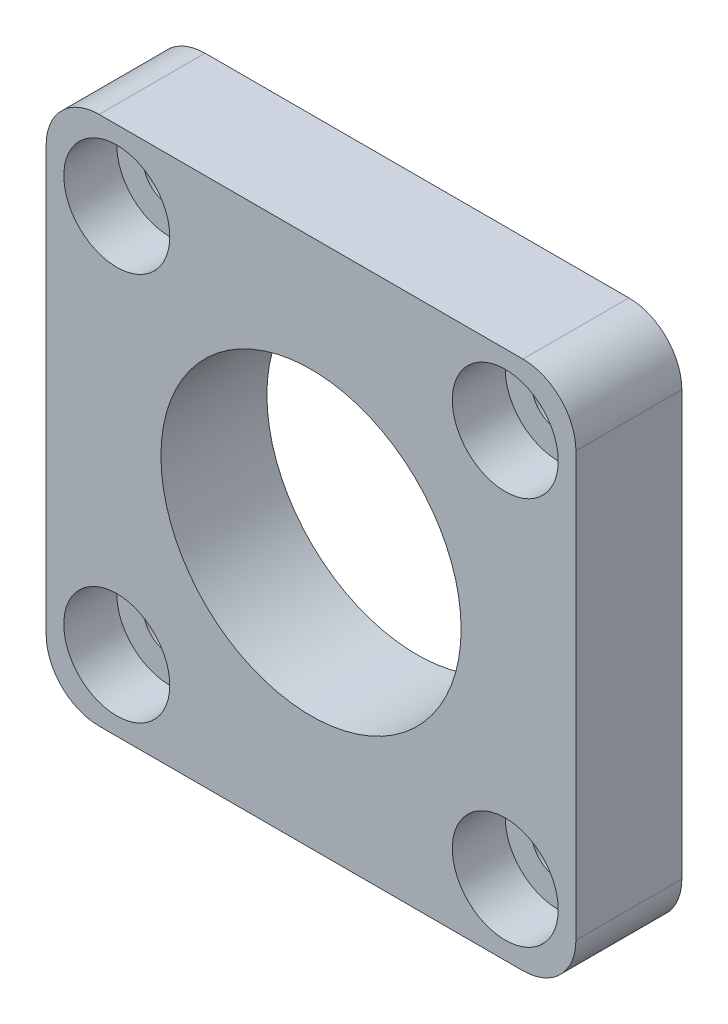
ISO-10303-21;
HEADER;
FILE_DESCRIPTION(('STEP AP214'),'2;1');
FILE_NAME('part.step','',(''),(''),'','','');
FILE_SCHEMA(('AUTOMOTIVE_DESIGN { 1 0 10303 214 1 1 1 1 }'));
ENDSEC;
DATA;
#1=APPLICATION_CONTEXT('core data for automotive mechanical design processes');
#2=APPLICATION_PROTOCOL_DEFINITION('international standard','automotive_design',2000,#1);
#3=PRODUCT_CONTEXT('',#1,'mechanical');
#4=PRODUCT('Part','Part','',(#3));
#5=PRODUCT_RELATED_PRODUCT_CATEGORY('part','',(#4));
#6=PRODUCT_DEFINITION_FORMATION('','',#4);
#7=PRODUCT_DEFINITION_CONTEXT('part definition',#1,'design');
#8=PRODUCT_DEFINITION('design','',#6,#7);
#9=PRODUCT_DEFINITION_SHAPE('','',#8);
#10=(LENGTH_UNIT() NAMED_UNIT(*) SI_UNIT(.MILLI.,.METRE.));
#11=(NAMED_UNIT(*) PLANE_ANGLE_UNIT() SI_UNIT($,.RADIAN.));
#12=(NAMED_UNIT(*) SI_UNIT($,.STERADIAN.) SOLID_ANGLE_UNIT());
#13=UNCERTAINTY_MEASURE_WITH_UNIT(LENGTH_MEASURE(1.E-05),#10,'distance_accuracy_value','');
#14=(GEOMETRIC_REPRESENTATION_CONTEXT(3) GLOBAL_UNCERTAINTY_ASSIGNED_CONTEXT((#13)) GLOBAL_UNIT_ASSIGNED_CONTEXT((#10,
#11,#12)) REPRESENTATION_CONTEXT('',''));
#15=CARTESIAN_POINT('',(0.,0.,0.));
#16=DIRECTION('',(0.,0.,1.));
#17=DIRECTION('',(1.,0.,0.));
#18=AXIS2_PLACEMENT_3D('',#15,#16,#17);
#19=CARTESIAN_POINT('',(-11.,-11.,0.));
#20=DIRECTION('',(0.,0.,1.));
#21=DIRECTION('',(1.,0.,0.));
#22=AXIS2_PLACEMENT_3D('',#19,#20,#21);
#23=CYLINDRICAL_SURFACE('',#22,1.5);
#24=CARTESIAN_POINT('',(-11.,-11.,0.));
#25=DIRECTION('',(0.,0.,1.));
#26=DIRECTION('',(1.,0.,0.));
#27=AXIS2_PLACEMENT_3D('',#24,#25,#26);
#28=CIRCLE('',#27,1.5);
#29=CARTESIAN_POINT('',(-9.5,-11.,0.));
#30=VERTEX_POINT('',#29);
#31=EDGE_CURVE('E138',#30,#30,#28,.T.);
#32=ORIENTED_EDGE('',*,*,#31,.F.);
#33=EDGE_LOOP('',(#32));
#34=FACE_BOUND('',#33,.T.);
#35=CARTESIAN_POINT('',(-11.,-11.,3.));
#36=DIRECTION('',(0.,0.,1.));
#37=DIRECTION('',(1.,0.,0.));
#38=AXIS2_PLACEMENT_3D('',#35,#36,#37);
#39=CIRCLE('',#38,1.5);
#40=CARTESIAN_POINT('',(-9.5,-11.,3.));
#41=VERTEX_POINT('',#40);
#42=EDGE_CURVE('E150',#41,#41,#39,.F.);
#43=ORIENTED_EDGE('',*,*,#42,.F.);
#44=EDGE_LOOP('',(#43));
#45=FACE_BOUND('',#44,.T.);
#46=ADVANCED_FACE('F33',(#34,#45),#23,.F.);
#47=CARTESIAN_POINT('',(11.,-11.,0.));
#48=DIRECTION('',(0.,0.,1.));
#49=DIRECTION('',(1.,0.,0.));
#50=AXIS2_PLACEMENT_3D('',#47,#48,#49);
#51=CYLINDRICAL_SURFACE('',#50,1.5);
#52=CARTESIAN_POINT('',(11.,-11.,0.));
#53=DIRECTION('',(0.,0.,1.));
#54=DIRECTION('',(1.,0.,0.));
#55=AXIS2_PLACEMENT_3D('',#52,#53,#54);
#56=CIRCLE('',#55,1.5);
#57=CARTESIAN_POINT('',(12.5,-11.,0.));
#58=VERTEX_POINT('',#57);
#59=EDGE_CURVE('E203',#58,#58,#56,.T.);
#60=ORIENTED_EDGE('',*,*,#59,.F.);
#61=EDGE_LOOP('',(#60));
#62=FACE_BOUND('',#61,.T.);
#63=CARTESIAN_POINT('',(11.,-11.,3.));
#64=DIRECTION('',(0.,0.,1.));
#65=DIRECTION('',(1.,0.,0.));
#66=AXIS2_PLACEMENT_3D('',#63,#64,#65);
#67=CIRCLE('',#66,1.5);
#68=CARTESIAN_POINT('',(12.5,-11.,3.));
#69=VERTEX_POINT('',#68);
#70=EDGE_CURVE('E145',#69,#69,#67,.F.);
#71=ORIENTED_EDGE('',*,*,#70,.F.);
#72=EDGE_LOOP('',(#71));
#73=FACE_BOUND('',#72,.T.);
#74=ADVANCED_FACE('F266',(#62,#73),#51,.F.);
#75=CARTESIAN_POINT('',(11.,11.,0.));
#76=DIRECTION('',(0.,0.,1.));
#77=DIRECTION('',(1.,0.,0.));
#78=AXIS2_PLACEMENT_3D('',#75,#76,#77);
#79=CYLINDRICAL_SURFACE('',#78,1.5);
#80=CARTESIAN_POINT('',(11.,11.,0.));
#81=DIRECTION('',(0.,0.,1.));
#82=DIRECTION('',(1.,0.,0.));
#83=AXIS2_PLACEMENT_3D('',#80,#81,#82);
#84=CIRCLE('',#83,1.5);
#85=CARTESIAN_POINT('',(12.5,11.,0.));
#86=VERTEX_POINT('',#85);
#87=EDGE_CURVE('E200',#86,#86,#84,.T.);
#88=ORIENTED_EDGE('',*,*,#87,.F.);
#89=EDGE_LOOP('',(#88));
#90=FACE_BOUND('',#89,.T.);
#91=CARTESIAN_POINT('',(11.,11.,3.));
#92=DIRECTION('',(0.,0.,1.));
#93=DIRECTION('',(1.,0.,0.));
#94=AXIS2_PLACEMENT_3D('',#91,#92,#93);
#95=CIRCLE('',#94,1.5);
#96=CARTESIAN_POINT('',(12.5,11.,3.));
#97=VERTEX_POINT('',#96);
#98=EDGE_CURVE('E140',#97,#97,#95,.F.);
#99=ORIENTED_EDGE('',*,*,#98,.F.);
#100=EDGE_LOOP('',(#99));
#101=FACE_BOUND('',#100,.T.);
#102=ADVANCED_FACE('F272',(#90,#101),#79,.F.);
#103=CARTESIAN_POINT('',(-11.,11.,0.));
#104=DIRECTION('',(0.,0.,1.));
#105=DIRECTION('',(1.,0.,0.));
#106=AXIS2_PLACEMENT_3D('',#103,#104,#105);
#107=CYLINDRICAL_SURFACE('',#106,1.5);
#108=CARTESIAN_POINT('',(-11.,11.,0.));
#109=DIRECTION('',(0.,0.,1.));
#110=DIRECTION('',(1.,0.,0.));
#111=AXIS2_PLACEMENT_3D('',#108,#109,#110);
#112=CIRCLE('',#111,1.5);
#113=CARTESIAN_POINT('',(-9.5,11.,0.));
#114=VERTEX_POINT('',#113);
#115=EDGE_CURVE('E196',#114,#114,#112,.T.);
#116=ORIENTED_EDGE('',*,*,#115,.F.);
#117=EDGE_LOOP('',(#116));
#118=FACE_BOUND('',#117,.T.);
#119=CARTESIAN_POINT('',(-11.,11.,3.));
#120=DIRECTION('',(0.,0.,1.));
#121=DIRECTION('',(1.,0.,0.));
#122=AXIS2_PLACEMENT_3D('',#119,#120,#121);
#123=CIRCLE('',#122,1.5);
#124=CARTESIAN_POINT('',(-9.5,11.,3.));
#125=VERTEX_POINT('',#124);
#126=EDGE_CURVE('E135',#125,#125,#123,.F.);
#127=ORIENTED_EDGE('',*,*,#126,.F.);
#128=EDGE_LOOP('',(#127));
#129=FACE_BOUND('',#128,.T.);
#130=ADVANCED_FACE('F238',(#118,#129),#107,.F.);
#131=CARTESIAN_POINT('',(0.,0.,6.));
#132=DIRECTION('',(0.,0.,-1.));
#133=DIRECTION('',(-1.,0.,0.));
#134=AXIS2_PLACEMENT_3D('',#131,#132,#133);
#135=PLANE('',#134);
#136=CARTESIAN_POINT('',(-11.,-11.,6.));
#137=DIRECTION('',(0.,0.,1.));
#138=DIRECTION('',(1.,0.,0.));
#139=AXIS2_PLACEMENT_3D('',#136,#137,#138);
#140=CIRCLE('',#139,3.);
#141=CARTESIAN_POINT('',(-8.,-11.,6.));
#142=VERTEX_POINT('',#141);
#143=EDGE_CURVE('E220',#142,#142,#140,.T.);
#144=ORIENTED_EDGE('',*,*,#143,.F.);
#145=EDGE_LOOP('',(#144));
#146=FACE_BOUND('',#145,.T.);
#147=CARTESIAN_POINT('',(11.,-11.,6.));
#148=DIRECTION('',(0.,0.,1.));
#149=DIRECTION('',(1.,0.,0.));
#150=AXIS2_PLACEMENT_3D('',#147,#148,#149);
#151=CIRCLE('',#150,3.);
#152=CARTESIAN_POINT('',(14.,-11.,6.));
#153=VERTEX_POINT('',#152);
#154=EDGE_CURVE('E153',#153,#153,#151,.T.);
#155=ORIENTED_EDGE('',*,*,#154,.F.);
#156=EDGE_LOOP('',(#155));
#157=FACE_BOUND('',#156,.T.);
#158=CARTESIAN_POINT('',(11.,11.,6.));
#159=DIRECTION('',(0.,0.,1.));
#160=DIRECTION('',(1.,0.,0.));
#161=AXIS2_PLACEMENT_3D('',#158,#159,#160);
#162=CIRCLE('',#161,3.);
#163=CARTESIAN_POINT('',(14.,11.,6.));
#164=VERTEX_POINT('',#163);
#165=EDGE_CURVE('E148',#164,#164,#162,.T.);
#166=ORIENTED_EDGE('',*,*,#165,.F.);
#167=EDGE_LOOP('',(#166));
#168=FACE_BOUND('',#167,.T.);
#169=CARTESIAN_POINT('',(-11.,11.,6.));
#170=DIRECTION('',(0.,0.,1.));
#171=DIRECTION('',(1.,0.,0.));
#172=AXIS2_PLACEMENT_3D('',#169,#170,#171);
#173=CIRCLE('',#172,3.);
#174=CARTESIAN_POINT('',(-8.,11.,6.));
#175=VERTEX_POINT('',#174);
#176=EDGE_CURVE('E143',#175,#175,#173,.T.);
#177=ORIENTED_EDGE('',*,*,#176,.F.);
#178=EDGE_LOOP('',(#177));
#179=FACE_BOUND('',#178,.T.);
#180=DIRECTION('',(0.,-1.,0.));
#181=VECTOR('',#180,1.);
#182=CARTESIAN_POINT('',(-15.,-15.,6.));
#183=LINE('',#182,#181);
#184=CARTESIAN_POINT('',(-15.,12.,6.));
#185=VERTEX_POINT('',#184);
#186=CARTESIAN_POINT('',(-15.,-12.,6.));
#187=VERTEX_POINT('',#186);
#188=EDGE_CURVE('E191',#185,#187,#183,.T.);
#189=ORIENTED_EDGE('',*,*,#188,.T.);
#190=CARTESIAN_POINT('',(-12.,-12.,6.));
#191=DIRECTION('',(0.,0.,-1.));
#192=DIRECTION('',(-1.,0.,0.));
#193=AXIS2_PLACEMENT_3D('',#190,#191,#192);
#194=CIRCLE('',#193,3.);
#195=CARTESIAN_POINT('',(-12.,-15.,6.));
#196=VERTEX_POINT('',#195);
#197=EDGE_CURVE('E168',#187,#196,#194,.F.);
#198=ORIENTED_EDGE('',*,*,#197,.T.);
#199=DIRECTION('',(1.,0.,0.));
#200=VECTOR('',#199,1.);
#201=CARTESIAN_POINT('',(-15.,-15.,6.));
#202=LINE('',#201,#200);
#203=CARTESIAN_POINT('',(12.,-15.,6.));
#204=VERTEX_POINT('',#203);
#205=EDGE_CURVE('E119',#196,#204,#202,.T.);
#206=ORIENTED_EDGE('',*,*,#205,.T.);
#207=CARTESIAN_POINT('',(12.,-12.,6.));
#208=DIRECTION('',(0.,0.,-1.));
#209=DIRECTION('',(-1.,0.,0.));
#210=AXIS2_PLACEMENT_3D('',#207,#208,#209);
#211=CIRCLE('',#210,3.);
#212=CARTESIAN_POINT('',(15.,-12.,6.));
#213=VERTEX_POINT('',#212);
#214=EDGE_CURVE('E166',#204,#213,#211,.F.);
#215=ORIENTED_EDGE('',*,*,#214,.T.);
#216=DIRECTION('',(0.,1.,0.));
#217=VECTOR('',#216,1.);
#218=CARTESIAN_POINT('',(15.,-15.,6.));
#219=LINE('',#218,#217);
#220=CARTESIAN_POINT('',(15.,12.,6.));
#221=VERTEX_POINT('',#220);
#222=EDGE_CURVE('E126',#213,#221,#219,.T.);
#223=ORIENTED_EDGE('',*,*,#222,.T.);
#224=CARTESIAN_POINT('',(12.,12.,6.));
#225=DIRECTION('',(0.,0.,-1.));
#226=DIRECTION('',(-1.,0.,0.));
#227=AXIS2_PLACEMENT_3D('',#224,#225,#226);
#228=CIRCLE('',#227,3.);
#229=CARTESIAN_POINT('',(12.,15.,6.));
#230=VERTEX_POINT('',#229);
#231=EDGE_CURVE('E54',#221,#230,#228,.F.);
#232=ORIENTED_EDGE('',*,*,#231,.T.);
#233=DIRECTION('',(-1.,0.,0.));
#234=VECTOR('',#233,1.);
#235=CARTESIAN_POINT('',(-15.,15.,6.));
#236=LINE('',#235,#234);
#237=CARTESIAN_POINT('',(-12.,15.,6.));
#238=VERTEX_POINT('',#237);
#239=EDGE_CURVE('E129',#230,#238,#236,.T.);
#240=ORIENTED_EDGE('',*,*,#239,.T.);
#241=CARTESIAN_POINT('',(-12.,12.,6.));
#242=DIRECTION('',(0.,0.,-1.));
#243=DIRECTION('',(-1.,0.,0.));
#244=AXIS2_PLACEMENT_3D('',#241,#242,#243);
#245=CIRCLE('',#244,3.);
#246=EDGE_CURVE('E163',#238,#185,#245,.F.);
#247=ORIENTED_EDGE('',*,*,#246,.T.);
#248=EDGE_LOOP('',(#189,#198,#206,#215,#223,#232,#240,#247));
#249=FACE_BOUND('',#248,.T.);
#250=CARTESIAN_POINT('',(0.,0.,6.));
#251=DIRECTION('',(0.,0.,1.));
#252=DIRECTION('',(1.,0.,0.));
#253=AXIS2_PLACEMENT_3D('',#250,#251,#252);
#254=CIRCLE('',#253,8.5);
#255=CARTESIAN_POINT('',(8.5,0.,6.));
#256=VERTEX_POINT('',#255);
#257=EDGE_CURVE('E184',#256,#256,#254,.T.);
#258=ORIENTED_EDGE('',*,*,#257,.F.);
#259=EDGE_LOOP('',(#258));
#260=FACE_BOUND('',#259,.T.);
#261=ADVANCED_FACE('F235',(#146,#157,#168,#179,#249,#260),#135,.F.);
#262=CARTESIAN_POINT('',(0.,0.,0.));
#263=DIRECTION('',(0.,0.,-1.));
#264=DIRECTION('',(-1.,0.,0.));
#265=AXIS2_PLACEMENT_3D('',#262,#263,#264);
#266=PLANE('',#265);
#267=ORIENTED_EDGE('',*,*,#31,.T.);
#268=EDGE_LOOP('',(#267));
#269=FACE_BOUND('',#268,.T.);
#270=ORIENTED_EDGE('',*,*,#59,.T.);
#271=EDGE_LOOP('',(#270));
#272=FACE_BOUND('',#271,.T.);
#273=ORIENTED_EDGE('',*,*,#87,.T.);
#274=EDGE_LOOP('',(#273));
#275=FACE_BOUND('',#274,.T.);
#276=ORIENTED_EDGE('',*,*,#115,.T.);
#277=EDGE_LOOP('',(#276));
#278=FACE_BOUND('',#277,.T.);
#279=DIRECTION('',(1.,0.,0.));
#280=VECTOR('',#279,1.);
#281=CARTESIAN_POINT('',(-15.,-15.,0.));
#282=LINE('',#281,#280);
#283=CARTESIAN_POINT('',(-12.,-15.,0.));
#284=VERTEX_POINT('',#283);
#285=CARTESIAN_POINT('',(12.,-15.,0.));
#286=VERTEX_POINT('',#285);
#287=EDGE_CURVE('E116',#284,#286,#282,.T.);
#288=ORIENTED_EDGE('',*,*,#287,.F.);
#289=CARTESIAN_POINT('',(-12.,-12.,0.));
#290=DIRECTION('',(0.,0.,-1.));
#291=DIRECTION('',(-1.,0.,0.));
#292=AXIS2_PLACEMENT_3D('',#289,#290,#291);
#293=CIRCLE('',#292,3.);
#294=CARTESIAN_POINT('',(-15.,-12.,0.));
#295=VERTEX_POINT('',#294);
#296=EDGE_CURVE('E99',#284,#295,#293,.T.);
#297=ORIENTED_EDGE('',*,*,#296,.T.);
#298=DIRECTION('',(0.,-1.,0.));
#299=VECTOR('',#298,1.);
#300=CARTESIAN_POINT('',(-15.,-15.,0.));
#301=LINE('',#300,#299);
#302=CARTESIAN_POINT('',(-15.,12.,0.));
#303=VERTEX_POINT('',#302);
#304=EDGE_CURVE('E127',#303,#295,#301,.T.);
#305=ORIENTED_EDGE('',*,*,#304,.F.);
#306=CARTESIAN_POINT('',(-12.,12.,0.));
#307=DIRECTION('',(0.,0.,-1.));
#308=DIRECTION('',(-1.,0.,0.));
#309=AXIS2_PLACEMENT_3D('',#306,#307,#308);
#310=CIRCLE('',#309,3.);
#311=CARTESIAN_POINT('',(-12.,15.,0.));
#312=VERTEX_POINT('',#311);
#313=EDGE_CURVE('E120',#303,#312,#310,.T.);
#314=ORIENTED_EDGE('',*,*,#313,.T.);
#315=DIRECTION('',(-1.,0.,0.));
#316=VECTOR('',#315,1.);
#317=CARTESIAN_POINT('',(-15.,15.,0.));
#318=LINE('',#317,#316);
#319=CARTESIAN_POINT('',(12.,15.,0.));
#320=VERTEX_POINT('',#319);
#321=EDGE_CURVE('E131',#320,#312,#318,.T.);
#322=ORIENTED_EDGE('',*,*,#321,.F.);
#323=CARTESIAN_POINT('',(12.,12.,0.));
#324=DIRECTION('',(0.,0.,-1.));
#325=DIRECTION('',(-1.,0.,0.));
#326=AXIS2_PLACEMENT_3D('',#323,#324,#325);
#327=CIRCLE('',#326,3.);
#328=CARTESIAN_POINT('',(15.,12.,0.));
#329=VERTEX_POINT('',#328);
#330=EDGE_CURVE('E157',#320,#329,#327,.T.);
#331=ORIENTED_EDGE('',*,*,#330,.T.);
#332=DIRECTION('',(0.,1.,0.));
#333=VECTOR('',#332,1.);
#334=CARTESIAN_POINT('',(15.,-15.,0.));
#335=LINE('',#334,#333);
#336=CARTESIAN_POINT('',(15.,-12.,0.));
#337=VERTEX_POINT('',#336);
#338=EDGE_CURVE('E179',#337,#329,#335,.T.);
#339=ORIENTED_EDGE('',*,*,#338,.F.);
#340=CARTESIAN_POINT('',(12.,-12.,0.));
#341=DIRECTION('',(0.,0.,-1.));
#342=DIRECTION('',(-1.,0.,0.));
#343=AXIS2_PLACEMENT_3D('',#340,#341,#342);
#344=CIRCLE('',#343,3.);
#345=EDGE_CURVE('E110',#337,#286,#344,.T.);
#346=ORIENTED_EDGE('',*,*,#345,.T.);
#347=EDGE_LOOP('',(#288,#297,#305,#314,#322,#331,#339,#346));
#348=FACE_BOUND('',#347,.T.);
#349=CARTESIAN_POINT('',(0.,0.,0.));
#350=DIRECTION('',(0.,0.,1.));
#351=DIRECTION('',(1.,0.,0.));
#352=AXIS2_PLACEMENT_3D('',#349,#350,#351);
#353=CIRCLE('',#352,8.5);
#354=CARTESIAN_POINT('',(8.5,0.,0.));
#355=VERTEX_POINT('',#354);
#356=EDGE_CURVE('E187',#355,#355,#353,.T.);
#357=ORIENTED_EDGE('',*,*,#356,.T.);
#358=EDGE_LOOP('',(#357));
#359=FACE_BOUND('',#358,.T.);
#360=ADVANCED_FACE('F123',(#269,#272,#275,#278,#348,#359),#266,.T.);
#361=CARTESIAN_POINT('',(15.,-15.,6.));
#362=DIRECTION('',(-1.,0.,0.));
#363=DIRECTION('',(0.,0.,1.));
#364=AXIS2_PLACEMENT_3D('',#361,#362,#363);
#365=PLANE('',#364);
#366=ORIENTED_EDGE('',*,*,#222,.F.);
#367=DIRECTION('',(0.,0.,-1.));
#368=VECTOR('',#367,1.);
#369=CARTESIAN_POINT('',(15.,-12.,6.));
#370=LINE('',#369,#368);
#371=EDGE_CURVE('E172',#213,#337,#370,.T.);
#372=ORIENTED_EDGE('',*,*,#371,.T.);
#373=ORIENTED_EDGE('',*,*,#338,.T.);
#374=DIRECTION('',(0.,0.,-1.));
#375=VECTOR('',#374,1.);
#376=CARTESIAN_POINT('',(15.,12.,6.));
#377=LINE('',#376,#375);
#378=EDGE_CURVE('E170',#329,#221,#377,.F.);
#379=ORIENTED_EDGE('',*,*,#378,.T.);
#380=EDGE_LOOP('',(#366,#372,#373,#379));
#381=FACE_BOUND('',#380,.T.);
#382=ADVANCED_FACE('F178',(#381),#365,.F.);
#383=CARTESIAN_POINT('',(-15.,15.,6.));
#384=DIRECTION('',(0.,-1.,0.));
#385=DIRECTION('',(0.,0.,-1.));
#386=AXIS2_PLACEMENT_3D('',#383,#384,#385);
#387=PLANE('',#386);
#388=ORIENTED_EDGE('',*,*,#239,.F.);
#389=DIRECTION('',(0.,0.,-1.));
#390=VECTOR('',#389,1.);
#391=CARTESIAN_POINT('',(12.,15.,6.));
#392=LINE('',#391,#390);
#393=EDGE_CURVE('E11',#230,#320,#392,.T.);
#394=ORIENTED_EDGE('',*,*,#393,.T.);
#395=ORIENTED_EDGE('',*,*,#321,.T.);
#396=DIRECTION('',(0.,0.,-1.));
#397=VECTOR('',#396,1.);
#398=CARTESIAN_POINT('',(-12.,15.,6.));
#399=LINE('',#398,#397);
#400=EDGE_CURVE('E41',#312,#238,#399,.F.);
#401=ORIENTED_EDGE('',*,*,#400,.T.);
#402=EDGE_LOOP('',(#388,#394,#395,#401));
#403=FACE_BOUND('',#402,.T.);
#404=ADVANCED_FACE('F261',(#403),#387,.F.);
#405=CARTESIAN_POINT('',(-15.,-15.,6.));
#406=DIRECTION('',(1.,0.,0.));
#407=DIRECTION('',(0.,0.,-1.));
#408=AXIS2_PLACEMENT_3D('',#405,#406,#407);
#409=PLANE('',#408);
#410=ORIENTED_EDGE('',*,*,#304,.T.);
#411=DIRECTION('',(0.,0.,-1.));
#412=VECTOR('',#411,1.);
#413=CARTESIAN_POINT('',(-15.,-12.,6.));
#414=LINE('',#413,#412);
#415=EDGE_CURVE('E104',#295,#187,#414,.F.);
#416=ORIENTED_EDGE('',*,*,#415,.T.);
#417=ORIENTED_EDGE('',*,*,#188,.F.);
#418=DIRECTION('',(0.,0.,-1.));
#419=VECTOR('',#418,1.);
#420=CARTESIAN_POINT('',(-15.,12.,6.));
#421=LINE('',#420,#419);
#422=EDGE_CURVE('E109',#185,#303,#421,.T.);
#423=ORIENTED_EDGE('',*,*,#422,.T.);
#424=EDGE_LOOP('',(#410,#416,#417,#423));
#425=FACE_BOUND('',#424,.T.);
#426=ADVANCED_FACE('F422',(#425),#409,.F.);
#427=CARTESIAN_POINT('',(-15.,-15.,6.));
#428=DIRECTION('',(0.,1.,0.));
#429=DIRECTION('',(0.,0.,1.));
#430=AXIS2_PLACEMENT_3D('',#427,#428,#429);
#431=PLANE('',#430);
#432=ORIENTED_EDGE('',*,*,#205,.F.);
#433=DIRECTION('',(0.,0.,-1.));
#434=VECTOR('',#433,1.);
#435=CARTESIAN_POINT('',(-12.,-15.,6.));
#436=LINE('',#435,#434);
#437=EDGE_CURVE('E103',#196,#284,#436,.T.);
#438=ORIENTED_EDGE('',*,*,#437,.T.);
#439=ORIENTED_EDGE('',*,*,#287,.T.);
#440=DIRECTION('',(0.,0.,-1.));
#441=VECTOR('',#440,1.);
#442=CARTESIAN_POINT('',(12.,-15.,6.));
#443=LINE('',#442,#441);
#444=EDGE_CURVE('E121',#286,#204,#443,.F.);
#445=ORIENTED_EDGE('',*,*,#444,.T.);
#446=EDGE_LOOP('',(#432,#438,#439,#445));
#447=FACE_BOUND('',#446,.T.);
#448=ADVANCED_FACE('F115',(#447),#431,.F.);
#449=CARTESIAN_POINT('',(0.,0.,6.));
#450=DIRECTION('',(0.,0.,-1.));
#451=DIRECTION('',(-1.,0.,0.));
#452=AXIS2_PLACEMENT_3D('',#449,#450,#451);
#453=CYLINDRICAL_SURFACE('',#452,8.5);
#454=ORIENTED_EDGE('',*,*,#257,.T.);
#455=EDGE_LOOP('',(#454));
#456=FACE_BOUND('',#455,.T.);
#457=ORIENTED_EDGE('',*,*,#356,.F.);
#458=EDGE_LOOP('',(#457));
#459=FACE_BOUND('',#458,.T.);
#460=ADVANCED_FACE('F249',(#456,#459),#453,.F.);
#461=CARTESIAN_POINT('',(-11.,11.,3.));
#462=DIRECTION('',(0.,0.,1.));
#463=DIRECTION('',(1.,0.,0.));
#464=AXIS2_PLACEMENT_3D('',#461,#462,#463);
#465=PLANE('',#464);
#466=CARTESIAN_POINT('',(-11.,11.,3.));
#467=DIRECTION('',(0.,0.,1.));
#468=DIRECTION('',(1.,0.,0.));
#469=AXIS2_PLACEMENT_3D('',#466,#467,#468);
#470=CIRCLE('',#469,3.);
#471=CARTESIAN_POINT('',(-8.,11.,3.));
#472=VERTEX_POINT('',#471);
#473=EDGE_CURVE('E139',#472,#472,#470,.T.);
#474=ORIENTED_EDGE('',*,*,#473,.T.);
#475=EDGE_LOOP('',(#474));
#476=FACE_BOUND('',#475,.T.);
#477=ORIENTED_EDGE('',*,*,#126,.T.);
#478=EDGE_LOOP('',(#477));
#479=FACE_BOUND('',#478,.T.);
#480=ADVANCED_FACE('F252',(#476,#479),#465,.T.);
#481=CARTESIAN_POINT('',(-11.,11.,3.));
#482=DIRECTION('',(0.,0.,1.));
#483=DIRECTION('',(1.,0.,0.));
#484=AXIS2_PLACEMENT_3D('',#481,#482,#483);
#485=CYLINDRICAL_SURFACE('',#484,3.);
#486=ORIENTED_EDGE('',*,*,#473,.F.);
#487=EDGE_LOOP('',(#486));
#488=FACE_BOUND('',#487,.T.);
#489=ORIENTED_EDGE('',*,*,#176,.T.);
#490=EDGE_LOOP('',(#489));
#491=FACE_BOUND('',#490,.T.);
#492=ADVANCED_FACE('F278',(#488,#491),#485,.F.);
#493=CARTESIAN_POINT('',(11.,11.,3.));
#494=DIRECTION('',(0.,0.,1.));
#495=DIRECTION('',(1.,0.,0.));
#496=AXIS2_PLACEMENT_3D('',#493,#494,#495);
#497=PLANE('',#496);
#498=CARTESIAN_POINT('',(11.,11.,3.));
#499=DIRECTION('',(0.,0.,1.));
#500=DIRECTION('',(1.,0.,0.));
#501=AXIS2_PLACEMENT_3D('',#498,#499,#500);
#502=CIRCLE('',#501,3.);
#503=CARTESIAN_POINT('',(14.,11.,3.));
#504=VERTEX_POINT('',#503);
#505=EDGE_CURVE('E144',#504,#504,#502,.T.);
#506=ORIENTED_EDGE('',*,*,#505,.T.);
#507=EDGE_LOOP('',(#506));
#508=FACE_BOUND('',#507,.T.);
#509=ORIENTED_EDGE('',*,*,#98,.T.);
#510=EDGE_LOOP('',(#509));
#511=FACE_BOUND('',#510,.T.);
#512=ADVANCED_FACE('F297',(#508,#511),#497,.T.);
#513=CARTESIAN_POINT('',(11.,11.,3.));
#514=DIRECTION('',(0.,0.,1.));
#515=DIRECTION('',(1.,0.,0.));
#516=AXIS2_PLACEMENT_3D('',#513,#514,#515);
#517=CYLINDRICAL_SURFACE('',#516,3.);
#518=ORIENTED_EDGE('',*,*,#505,.F.);
#519=EDGE_LOOP('',(#518));
#520=FACE_BOUND('',#519,.T.);
#521=ORIENTED_EDGE('',*,*,#165,.T.);
#522=EDGE_LOOP('',(#521));
#523=FACE_BOUND('',#522,.T.);
#524=ADVANCED_FACE('F300',(#520,#523),#517,.F.);
#525=CARTESIAN_POINT('',(11.,-11.,3.));
#526=DIRECTION('',(0.,0.,1.));
#527=DIRECTION('',(1.,0.,0.));
#528=AXIS2_PLACEMENT_3D('',#525,#526,#527);
#529=PLANE('',#528);
#530=CARTESIAN_POINT('',(11.,-11.,3.));
#531=DIRECTION('',(0.,0.,1.));
#532=DIRECTION('',(1.,0.,0.));
#533=AXIS2_PLACEMENT_3D('',#530,#531,#532);
#534=CIRCLE('',#533,3.);
#535=CARTESIAN_POINT('',(14.,-11.,3.));
#536=VERTEX_POINT('',#535);
#537=EDGE_CURVE('E149',#536,#536,#534,.T.);
#538=ORIENTED_EDGE('',*,*,#537,.T.);
#539=EDGE_LOOP('',(#538));
#540=FACE_BOUND('',#539,.T.);
#541=ORIENTED_EDGE('',*,*,#70,.T.);
#542=EDGE_LOOP('',(#541));
#543=FACE_BOUND('',#542,.T.);
#544=ADVANCED_FACE('F303',(#540,#543),#529,.T.);
#545=CARTESIAN_POINT('',(11.,-11.,3.));
#546=DIRECTION('',(0.,0.,1.));
#547=DIRECTION('',(1.,0.,0.));
#548=AXIS2_PLACEMENT_3D('',#545,#546,#547);
#549=CYLINDRICAL_SURFACE('',#548,3.);
#550=ORIENTED_EDGE('',*,*,#537,.F.);
#551=EDGE_LOOP('',(#550));
#552=FACE_BOUND('',#551,.T.);
#553=ORIENTED_EDGE('',*,*,#154,.T.);
#554=EDGE_LOOP('',(#553));
#555=FACE_BOUND('',#554,.T.);
#556=ADVANCED_FACE('F308',(#552,#555),#549,.F.);
#557=CARTESIAN_POINT('',(-11.,-11.,3.));
#558=DIRECTION('',(0.,0.,1.));
#559=DIRECTION('',(1.,0.,0.));
#560=AXIS2_PLACEMENT_3D('',#557,#558,#559);
#561=PLANE('',#560);
#562=CARTESIAN_POINT('',(-11.,-11.,3.));
#563=DIRECTION('',(0.,0.,1.));
#564=DIRECTION('',(1.,0.,0.));
#565=AXIS2_PLACEMENT_3D('',#562,#563,#564);
#566=CIRCLE('',#565,3.);
#567=CARTESIAN_POINT('',(-8.,-11.,3.));
#568=VERTEX_POINT('',#567);
#569=EDGE_CURVE('E154',#568,#568,#566,.T.);
#570=ORIENTED_EDGE('',*,*,#569,.T.);
#571=EDGE_LOOP('',(#570));
#572=FACE_BOUND('',#571,.T.);
#573=ORIENTED_EDGE('',*,*,#42,.T.);
#574=EDGE_LOOP('',(#573));
#575=FACE_BOUND('',#574,.T.);
#576=ADVANCED_FACE('F226',(#572,#575),#561,.T.);
#577=CARTESIAN_POINT('',(-11.,-11.,3.));
#578=DIRECTION('',(0.,0.,1.));
#579=DIRECTION('',(1.,0.,0.));
#580=AXIS2_PLACEMENT_3D('',#577,#578,#579);
#581=CYLINDRICAL_SURFACE('',#580,3.);
#582=ORIENTED_EDGE('',*,*,#569,.F.);
#583=EDGE_LOOP('',(#582));
#584=FACE_BOUND('',#583,.T.);
#585=ORIENTED_EDGE('',*,*,#143,.T.);
#586=EDGE_LOOP('',(#585));
#587=FACE_BOUND('',#586,.T.);
#588=ADVANCED_FACE('F229',(#584,#587),#581,.F.);
#589=CARTESIAN_POINT('',(-12.,-12.,6.));
#590=DIRECTION('',(0.,0.,-1.));
#591=DIRECTION('',(-1.,0.,0.));
#592=AXIS2_PLACEMENT_3D('',#589,#590,#591);
#593=CYLINDRICAL_SURFACE('',#592,3.);
#594=ORIENTED_EDGE('',*,*,#197,.F.);
#595=ORIENTED_EDGE('',*,*,#415,.F.);
#596=ORIENTED_EDGE('',*,*,#296,.F.);
#597=ORIENTED_EDGE('',*,*,#437,.F.);
#598=EDGE_LOOP('',(#594,#595,#596,#597));
#599=FACE_BOUND('',#598,.T.);
#600=ADVANCED_FACE('F102',(#599),#593,.T.);
#601=CARTESIAN_POINT('',(12.,-12.,6.));
#602=DIRECTION('',(0.,0.,-1.));
#603=DIRECTION('',(-1.,0.,0.));
#604=AXIS2_PLACEMENT_3D('',#601,#602,#603);
#605=CYLINDRICAL_SURFACE('',#604,3.);
#606=ORIENTED_EDGE('',*,*,#214,.F.);
#607=ORIENTED_EDGE('',*,*,#444,.F.);
#608=ORIENTED_EDGE('',*,*,#345,.F.);
#609=ORIENTED_EDGE('',*,*,#371,.F.);
#610=EDGE_LOOP('',(#606,#607,#608,#609));
#611=FACE_BOUND('',#610,.T.);
#612=ADVANCED_FACE('F331',(#611),#605,.T.);
#613=CARTESIAN_POINT('',(12.,12.,6.));
#614=DIRECTION('',(0.,0.,-1.));
#615=DIRECTION('',(-1.,0.,0.));
#616=AXIS2_PLACEMENT_3D('',#613,#614,#615);
#617=CYLINDRICAL_SURFACE('',#616,3.);
#618=ORIENTED_EDGE('',*,*,#231,.F.);
#619=ORIENTED_EDGE('',*,*,#378,.F.);
#620=ORIENTED_EDGE('',*,*,#330,.F.);
#621=ORIENTED_EDGE('',*,*,#393,.F.);
#622=EDGE_LOOP('',(#618,#619,#620,#621));
#623=FACE_BOUND('',#622,.T.);
#624=ADVANCED_FACE('F339',(#623),#617,.T.);
#625=CARTESIAN_POINT('',(-12.,12.,6.));
#626=DIRECTION('',(0.,0.,-1.));
#627=DIRECTION('',(-1.,0.,0.));
#628=AXIS2_PLACEMENT_3D('',#625,#626,#627);
#629=CYLINDRICAL_SURFACE('',#628,3.);
#630=ORIENTED_EDGE('',*,*,#246,.F.);
#631=ORIENTED_EDGE('',*,*,#400,.F.);
#632=ORIENTED_EDGE('',*,*,#313,.F.);
#633=ORIENTED_EDGE('',*,*,#422,.F.);
#634=EDGE_LOOP('',(#630,#631,#632,#633));
#635=FACE_BOUND('',#634,.T.);
#636=ADVANCED_FACE('F35',(#635),#629,.T.);
#637=CLOSED_SHELL('',(#46,#74,#102,#130,#261,#360,#382,#404,#426,#448,#460,#480,#492,#512,#524,
#544,#556,#576,#588,#600,#612,#624,#636));
#638=MANIFOLD_SOLID_BREP('B2',#637);
#639=ADVANCED_BREP_SHAPE_REPRESENTATION('',(#18,#638),#14);
#640=SHAPE_DEFINITION_REPRESENTATION(#9,#639);
ENDSEC;
END-ISO-10303-21;
